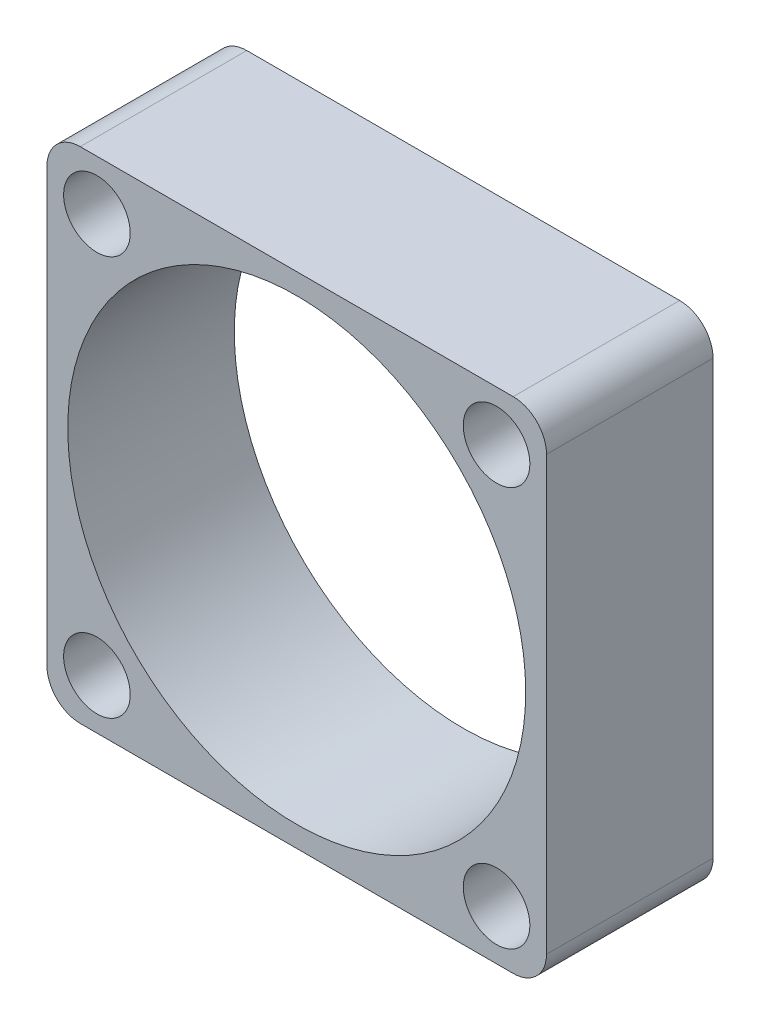
ISO-10303-21;
HEADER;
FILE_DESCRIPTION(('STEP AP214'),'2;1');
FILE_NAME('part.step','',(''),(''),'','','');
FILE_SCHEMA(('AUTOMOTIVE_DESIGN { 1 0 10303 214 1 1 1 1 }'));
ENDSEC;
DATA;
#1=APPLICATION_CONTEXT('core data for automotive mechanical design processes');
#2=APPLICATION_PROTOCOL_DEFINITION('international standard','automotive_design',2000,#1);
#3=PRODUCT_CONTEXT('',#1,'mechanical');
#4=PRODUCT('Part','Part','',(#3));
#5=PRODUCT_RELATED_PRODUCT_CATEGORY('part','',(#4));
#6=PRODUCT_DEFINITION_FORMATION('','',#4);
#7=PRODUCT_DEFINITION_CONTEXT('part definition',#1,'design');
#8=PRODUCT_DEFINITION('design','',#6,#7);
#9=PRODUCT_DEFINITION_SHAPE('','',#8);
#10=(LENGTH_UNIT() NAMED_UNIT(*) SI_UNIT(.MILLI.,.METRE.));
#11=(NAMED_UNIT(*) PLANE_ANGLE_UNIT() SI_UNIT($,.RADIAN.));
#12=(NAMED_UNIT(*) SI_UNIT($,.STERADIAN.) SOLID_ANGLE_UNIT());
#13=UNCERTAINTY_MEASURE_WITH_UNIT(LENGTH_MEASURE(1.E-05),#10,'distance_accuracy_value','');
#14=(GEOMETRIC_REPRESENTATION_CONTEXT(3) GLOBAL_UNCERTAINTY_ASSIGNED_CONTEXT((#13)) GLOBAL_UNIT_ASSIGNED_CONTEXT((#10,
#11,#12)) REPRESENTATION_CONTEXT('',''));
#15=CARTESIAN_POINT('',(0.,0.,0.));
#16=DIRECTION('',(0.,0.,1.));
#17=DIRECTION('',(1.,0.,0.));
#18=AXIS2_PLACEMENT_3D('',#15,#16,#17);
#19=CARTESIAN_POINT('',(0.,0.,10.));
#20=DIRECTION('',(1.,0.,0.));
#21=DIRECTION('',(0.,0.,-1.));
#22=AXIS2_PLACEMENT_3D('',#19,#20,#21);
#23=PLANE('',#22);
#24=DIRECTION('',(0.,-1.,0.));
#25=VECTOR('',#24,1.);
#26=CARTESIAN_POINT('',(0.,0.,0.));
#27=LINE('',#26,#25);
#28=CARTESIAN_POINT('',(0.,28.,0.));
#29=VERTEX_POINT('',#28);
#30=CARTESIAN_POINT('',(0.,2.,0.));
#31=VERTEX_POINT('',#30);
#32=EDGE_CURVE('E168',#29,#31,#27,.T.);
#33=ORIENTED_EDGE('',*,*,#32,.T.);
#34=DIRECTION('',(0.,0.,-1.));
#35=VECTOR('',#34,1.);
#36=CARTESIAN_POINT('',(0.,2.,10.));
#37=LINE('',#36,#35);
#38=CARTESIAN_POINT('',(0.,2.,10.));
#39=VERTEX_POINT('',#38);
#40=EDGE_CURVE('E144',#31,#39,#37,.F.);
#41=ORIENTED_EDGE('',*,*,#40,.T.);
#42=DIRECTION('',(0.,-1.,0.));
#43=VECTOR('',#42,1.);
#44=CARTESIAN_POINT('',(0.,0.,10.));
#45=LINE('',#44,#43);
#46=CARTESIAN_POINT('',(0.,28.,10.));
#47=VERTEX_POINT('',#46);
#48=EDGE_CURVE('E182',#47,#39,#45,.T.);
#49=ORIENTED_EDGE('',*,*,#48,.F.);
#50=DIRECTION('',(0.,0.,-1.));
#51=VECTOR('',#50,1.);
#52=CARTESIAN_POINT('',(0.,28.,10.));
#53=LINE('',#52,#51);
#54=EDGE_CURVE('E149',#47,#29,#53,.T.);
#55=ORIENTED_EDGE('',*,*,#54,.T.);
#56=EDGE_LOOP('',(#33,#41,#49,#55));
#57=FACE_BOUND('',#56,.T.);
#58=ADVANCED_FACE('F63',(#57),#23,.F.);
#59=CARTESIAN_POINT('',(0.,0.,10.));
#60=DIRECTION('',(0.,1.,0.));
#61=DIRECTION('',(0.,0.,1.));
#62=AXIS2_PLACEMENT_3D('',#59,#60,#61);
#63=PLANE('',#62);
#64=DIRECTION('',(1.,0.,0.));
#65=VECTOR('',#64,1.);
#66=CARTESIAN_POINT('',(0.,0.,10.));
#67=LINE('',#66,#65);
#68=CARTESIAN_POINT('',(2.,0.,10.));
#69=VERTEX_POINT('',#68);
#70=CARTESIAN_POINT('',(28.,0.,10.));
#71=VERTEX_POINT('',#70);
#72=EDGE_CURVE('E159',#69,#71,#67,.T.);
#73=ORIENTED_EDGE('',*,*,#72,.F.);
#74=DIRECTION('',(0.,0.,-1.));
#75=VECTOR('',#74,1.);
#76=CARTESIAN_POINT('',(2.,0.,10.));
#77=LINE('',#76,#75);
#78=CARTESIAN_POINT('',(2.,0.,0.));
#79=VERTEX_POINT('',#78);
#80=EDGE_CURVE('E143',#69,#79,#77,.T.);
#81=ORIENTED_EDGE('',*,*,#80,.T.);
#82=DIRECTION('',(1.,0.,0.));
#83=VECTOR('',#82,1.);
#84=CARTESIAN_POINT('',(0.,0.,0.));
#85=LINE('',#84,#83);
#86=CARTESIAN_POINT('',(28.,0.,0.));
#87=VERTEX_POINT('',#86);
#88=EDGE_CURVE('E156',#79,#87,#85,.T.);
#89=ORIENTED_EDGE('',*,*,#88,.T.);
#90=DIRECTION('',(0.,0.,-1.));
#91=VECTOR('',#90,1.);
#92=CARTESIAN_POINT('',(28.,0.,10.));
#93=LINE('',#92,#91);
#94=EDGE_CURVE('E162',#87,#71,#93,.F.);
#95=ORIENTED_EDGE('',*,*,#94,.T.);
#96=EDGE_LOOP('',(#73,#81,#89,#95));
#97=FACE_BOUND('',#96,.T.);
#98=ADVANCED_FACE('F155',(#97),#63,.F.);
#99=CARTESIAN_POINT('',(30.,0.,10.));
#100=DIRECTION('',(-1.,0.,0.));
#101=DIRECTION('',(0.,0.,1.));
#102=AXIS2_PLACEMENT_3D('',#99,#100,#101);
#103=PLANE('',#102);
#104=DIRECTION('',(0.,1.,0.));
#105=VECTOR('',#104,1.);
#106=CARTESIAN_POINT('',(30.,0.,10.));
#107=LINE('',#106,#105);
#108=CARTESIAN_POINT('',(30.,2.,10.));
#109=VERTEX_POINT('',#108);
#110=CARTESIAN_POINT('',(30.,28.,10.));
#111=VERTEX_POINT('',#110);
#112=EDGE_CURVE('E227',#109,#111,#107,.T.);
#113=ORIENTED_EDGE('',*,*,#112,.F.);
#114=DIRECTION('',(0.,0.,-1.));
#115=VECTOR('',#114,1.);
#116=CARTESIAN_POINT('',(30.,2.,10.));
#117=LINE('',#116,#115);
#118=CARTESIAN_POINT('',(30.,2.,0.));
#119=VERTEX_POINT('',#118);
#120=EDGE_CURVE('E209',#109,#119,#117,.T.);
#121=ORIENTED_EDGE('',*,*,#120,.T.);
#122=DIRECTION('',(0.,1.,0.));
#123=VECTOR('',#122,1.);
#124=CARTESIAN_POINT('',(30.,0.,0.));
#125=LINE('',#124,#123);
#126=CARTESIAN_POINT('',(30.,28.,0.));
#127=VERTEX_POINT('',#126);
#128=EDGE_CURVE('E167',#119,#127,#125,.T.);
#129=ORIENTED_EDGE('',*,*,#128,.T.);
#130=DIRECTION('',(0.,0.,-1.));
#131=VECTOR('',#130,1.);
#132=CARTESIAN_POINT('',(30.,28.,10.));
#133=LINE('',#132,#131);
#134=EDGE_CURVE('E206',#127,#111,#133,.F.);
#135=ORIENTED_EDGE('',*,*,#134,.T.);
#136=EDGE_LOOP('',(#113,#121,#129,#135));
#137=FACE_BOUND('',#136,.T.);
#138=ADVANCED_FACE('F246',(#137),#103,.F.);
#139=CARTESIAN_POINT('',(0.,30.,10.));
#140=DIRECTION('',(0.,-1.,0.));
#141=DIRECTION('',(0.,0.,-1.));
#142=AXIS2_PLACEMENT_3D('',#139,#140,#141);
#143=PLANE('',#142);
#144=DIRECTION('',(-1.,0.,0.));
#145=VECTOR('',#144,1.);
#146=CARTESIAN_POINT('',(0.,30.,0.));
#147=LINE('',#146,#145);
#148=CARTESIAN_POINT('',(28.,30.,0.));
#149=VERTEX_POINT('',#148);
#150=CARTESIAN_POINT('',(2.,30.,0.));
#151=VERTEX_POINT('',#150);
#152=EDGE_CURVE('E173',#149,#151,#147,.T.);
#153=ORIENTED_EDGE('',*,*,#152,.T.);
#154=DIRECTION('',(0.,0.,-1.));
#155=VECTOR('',#154,1.);
#156=CARTESIAN_POINT('',(2.,30.,10.));
#157=LINE('',#156,#155);
#158=CARTESIAN_POINT('',(2.,30.,10.));
#159=VERTEX_POINT('',#158);
#160=EDGE_CURVE('E12',#151,#159,#157,.F.);
#161=ORIENTED_EDGE('',*,*,#160,.T.);
#162=DIRECTION('',(-1.,0.,0.));
#163=VECTOR('',#162,1.);
#164=CARTESIAN_POINT('',(0.,30.,10.));
#165=LINE('',#164,#163);
#166=CARTESIAN_POINT('',(28.,30.,10.));
#167=VERTEX_POINT('',#166);
#168=EDGE_CURVE('E183',#167,#159,#165,.T.);
#169=ORIENTED_EDGE('',*,*,#168,.F.);
#170=DIRECTION('',(0.,0.,-1.));
#171=VECTOR('',#170,1.);
#172=CARTESIAN_POINT('',(28.,30.,10.));
#173=LINE('',#172,#171);
#174=EDGE_CURVE('E72',#167,#149,#173,.T.);
#175=ORIENTED_EDGE('',*,*,#174,.T.);
#176=EDGE_LOOP('',(#153,#161,#169,#175));
#177=FACE_BOUND('',#176,.T.);
#178=ADVANCED_FACE('F216',(#177),#143,.F.);
#179=CARTESIAN_POINT('',(0.,0.,10.));
#180=DIRECTION('',(0.,0.,-1.));
#181=DIRECTION('',(-1.,0.,0.));
#182=AXIS2_PLACEMENT_3D('',#179,#180,#181);
#183=PLANE('',#182);
#184=CARTESIAN_POINT('',(27.,27.,10.));
#185=DIRECTION('',(0.,0.,1.));
#186=DIRECTION('',(1.,0.,0.));
#187=AXIS2_PLACEMENT_3D('',#184,#185,#186);
#188=CIRCLE('',#187,2.00000000000001);
#189=CARTESIAN_POINT('',(29.,27.,10.));
#190=VERTEX_POINT('',#189);
#191=EDGE_CURVE('E403',#190,#190,#188,.T.);
#192=ORIENTED_EDGE('',*,*,#191,.F.);
#193=EDGE_LOOP('',(#192));
#194=FACE_BOUND('',#193,.T.);
#195=CARTESIAN_POINT('',(27.,3.,10.));
#196=DIRECTION('',(0.,0.,1.));
#197=DIRECTION('',(1.,0.,0.));
#198=AXIS2_PLACEMENT_3D('',#195,#196,#197);
#199=CIRCLE('',#198,2.);
#200=CARTESIAN_POINT('',(29.,3.,10.));
#201=VERTEX_POINT('',#200);
#202=EDGE_CURVE('E397',#201,#201,#199,.T.);
#203=ORIENTED_EDGE('',*,*,#202,.F.);
#204=EDGE_LOOP('',(#203));
#205=FACE_BOUND('',#204,.T.);
#206=CARTESIAN_POINT('',(2.99999999999999,3.,10.));
#207=DIRECTION('',(0.,0.,1.));
#208=DIRECTION('',(1.,0.,0.));
#209=AXIS2_PLACEMENT_3D('',#206,#207,#208);
#210=CIRCLE('',#209,2.);
#211=CARTESIAN_POINT('',(4.99999999999999,3.,10.));
#212=VERTEX_POINT('',#211);
#213=EDGE_CURVE('E390',#212,#212,#210,.T.);
#214=ORIENTED_EDGE('',*,*,#213,.F.);
#215=EDGE_LOOP('',(#214));
#216=FACE_BOUND('',#215,.T.);
#217=CARTESIAN_POINT('',(2.99999999999999,27.,10.));
#218=DIRECTION('',(0.,0.,1.));
#219=DIRECTION('',(1.,0.,0.));
#220=AXIS2_PLACEMENT_3D('',#217,#218,#219);
#221=CIRCLE('',#220,2.);
#222=CARTESIAN_POINT('',(4.99999999999999,27.,10.));
#223=VERTEX_POINT('',#222);
#224=EDGE_CURVE('E381',#223,#223,#221,.T.);
#225=ORIENTED_EDGE('',*,*,#224,.F.);
#226=EDGE_LOOP('',(#225));
#227=FACE_BOUND('',#226,.T.);
#228=CARTESIAN_POINT('',(15.,15.,10.));
#229=DIRECTION('',(0.,0.,1.));
#230=DIRECTION('',(1.,0.,0.));
#231=AXIS2_PLACEMENT_3D('',#228,#229,#230);
#232=CIRCLE('',#231,13.75);
#233=CARTESIAN_POINT('',(28.75,15.,10.));
#234=VERTEX_POINT('',#233);
#235=EDGE_CURVE('E230',#234,#234,#232,.T.);
#236=ORIENTED_EDGE('',*,*,#235,.F.);
#237=EDGE_LOOP('',(#236));
#238=FACE_BOUND('',#237,.T.);
#239=ORIENTED_EDGE('',*,*,#48,.T.);
#240=CARTESIAN_POINT('',(2.,2.,10.));
#241=DIRECTION('',(0.,0.,-1.));
#242=DIRECTION('',(-1.,0.,0.));
#243=AXIS2_PLACEMENT_3D('',#240,#241,#242);
#244=CIRCLE('',#243,2.);
#245=EDGE_CURVE('E203',#39,#69,#244,.F.);
#246=ORIENTED_EDGE('',*,*,#245,.T.);
#247=ORIENTED_EDGE('',*,*,#72,.T.);
#248=CARTESIAN_POINT('',(28.,2.,10.));
#249=DIRECTION('',(0.,0.,-1.));
#250=DIRECTION('',(-1.,0.,0.));
#251=AXIS2_PLACEMENT_3D('',#248,#249,#250);
#252=CIRCLE('',#251,2.);
#253=EDGE_CURVE('E201',#71,#109,#252,.F.);
#254=ORIENTED_EDGE('',*,*,#253,.T.);
#255=ORIENTED_EDGE('',*,*,#112,.T.);
#256=CARTESIAN_POINT('',(28.,28.,10.));
#257=DIRECTION('',(0.,0.,-1.));
#258=DIRECTION('',(-1.,0.,0.));
#259=AXIS2_PLACEMENT_3D('',#256,#257,#258);
#260=CIRCLE('',#259,2.);
#261=EDGE_CURVE('E89',#111,#167,#260,.F.);
#262=ORIENTED_EDGE('',*,*,#261,.T.);
#263=ORIENTED_EDGE('',*,*,#168,.T.);
#264=CARTESIAN_POINT('',(2.,28.,10.));
#265=DIRECTION('',(0.,0.,-1.));
#266=DIRECTION('',(-1.,0.,0.));
#267=AXIS2_PLACEMENT_3D('',#264,#265,#266);
#268=CIRCLE('',#267,2.);
#269=EDGE_CURVE('E198',#159,#47,#268,.F.);
#270=ORIENTED_EDGE('',*,*,#269,.T.);
#271=EDGE_LOOP('',(#239,#246,#247,#254,#255,#262,#263,#270));
#272=FACE_BOUND('',#271,.T.);
#273=ADVANCED_FACE('F235',(#194,#205,#216,#227,#238,#272),#183,.F.);
#274=CARTESIAN_POINT('',(0.,0.,0.));
#275=DIRECTION('',(0.,0.,-1.));
#276=DIRECTION('',(-1.,0.,0.));
#277=AXIS2_PLACEMENT_3D('',#274,#275,#276);
#278=PLANE('',#277);
#279=CARTESIAN_POINT('',(27.,27.,0.));
#280=DIRECTION('',(0.,0.,1.));
#281=DIRECTION('',(1.,0.,0.));
#282=AXIS2_PLACEMENT_3D('',#279,#280,#281);
#283=CIRCLE('',#282,2.00000000000001);
#284=CARTESIAN_POINT('',(29.,27.,0.));
#285=VERTEX_POINT('',#284);
#286=EDGE_CURVE('E400',#285,#285,#283,.T.);
#287=ORIENTED_EDGE('',*,*,#286,.T.);
#288=EDGE_LOOP('',(#287));
#289=FACE_BOUND('',#288,.T.);
#290=CARTESIAN_POINT('',(27.,3.,0.));
#291=DIRECTION('',(0.,0.,1.));
#292=DIRECTION('',(1.,0.,0.));
#293=AXIS2_PLACEMENT_3D('',#290,#291,#292);
#294=CIRCLE('',#293,2.);
#295=CARTESIAN_POINT('',(29.,3.,0.));
#296=VERTEX_POINT('',#295);
#297=EDGE_CURVE('E394',#296,#296,#294,.T.);
#298=ORIENTED_EDGE('',*,*,#297,.T.);
#299=EDGE_LOOP('',(#298));
#300=FACE_BOUND('',#299,.T.);
#301=CARTESIAN_POINT('',(2.99999999999999,3.,0.));
#302=DIRECTION('',(0.,0.,1.));
#303=DIRECTION('',(1.,0.,0.));
#304=AXIS2_PLACEMENT_3D('',#301,#302,#303);
#305=CIRCLE('',#304,2.);
#306=CARTESIAN_POINT('',(4.99999999999999,3.,0.));
#307=VERTEX_POINT('',#306);
#308=EDGE_CURVE('E387',#307,#307,#305,.T.);
#309=ORIENTED_EDGE('',*,*,#308,.T.);
#310=EDGE_LOOP('',(#309));
#311=FACE_BOUND('',#310,.T.);
#312=CARTESIAN_POINT('',(2.99999999999999,27.,0.));
#313=DIRECTION('',(0.,0.,1.));
#314=DIRECTION('',(1.,0.,0.));
#315=AXIS2_PLACEMENT_3D('',#312,#313,#314);
#316=CIRCLE('',#315,2.);
#317=CARTESIAN_POINT('',(4.99999999999999,27.,0.));
#318=VERTEX_POINT('',#317);
#319=EDGE_CURVE('E377',#318,#318,#316,.T.);
#320=ORIENTED_EDGE('',*,*,#319,.T.);
#321=EDGE_LOOP('',(#320));
#322=FACE_BOUND('',#321,.T.);
#323=CARTESIAN_POINT('',(15.,15.,0.));
#324=DIRECTION('',(0.,0.,1.));
#325=DIRECTION('',(1.,0.,0.));
#326=AXIS2_PLACEMENT_3D('',#323,#324,#325);
#327=CIRCLE('',#326,13.75);
#328=CARTESIAN_POINT('',(28.75,15.,0.));
#329=VERTEX_POINT('',#328);
#330=EDGE_CURVE('E176',#329,#329,#327,.T.);
#331=ORIENTED_EDGE('',*,*,#330,.T.);
#332=EDGE_LOOP('',(#331));
#333=FACE_BOUND('',#332,.T.);
#334=ORIENTED_EDGE('',*,*,#88,.F.);
#335=CARTESIAN_POINT('',(2.,2.,0.));
#336=DIRECTION('',(0.,0.,-1.));
#337=DIRECTION('',(-1.,0.,0.));
#338=AXIS2_PLACEMENT_3D('',#335,#336,#337);
#339=CIRCLE('',#338,2.);
#340=EDGE_CURVE('E139',#79,#31,#339,.T.);
#341=ORIENTED_EDGE('',*,*,#340,.T.);
#342=ORIENTED_EDGE('',*,*,#32,.F.);
#343=CARTESIAN_POINT('',(2.,28.,0.));
#344=DIRECTION('',(0.,0.,-1.));
#345=DIRECTION('',(-1.,0.,0.));
#346=AXIS2_PLACEMENT_3D('',#343,#344,#345);
#347=CIRCLE('',#346,2.);
#348=EDGE_CURVE('E187',#29,#151,#347,.T.);
#349=ORIENTED_EDGE('',*,*,#348,.T.);
#350=ORIENTED_EDGE('',*,*,#152,.F.);
#351=CARTESIAN_POINT('',(28.,28.,0.));
#352=DIRECTION('',(0.,0.,-1.));
#353=DIRECTION('',(-1.,0.,0.));
#354=AXIS2_PLACEMENT_3D('',#351,#352,#353);
#355=CIRCLE('',#354,2.);
#356=EDGE_CURVE('E161',#149,#127,#355,.T.);
#357=ORIENTED_EDGE('',*,*,#356,.T.);
#358=ORIENTED_EDGE('',*,*,#128,.F.);
#359=CARTESIAN_POINT('',(28.,2.,0.));
#360=DIRECTION('',(0.,0.,-1.));
#361=DIRECTION('',(-1.,0.,0.));
#362=AXIS2_PLACEMENT_3D('',#359,#360,#361);
#363=CIRCLE('',#362,2.);
#364=EDGE_CURVE('E150',#119,#87,#363,.T.);
#365=ORIENTED_EDGE('',*,*,#364,.T.);
#366=EDGE_LOOP('',(#334,#341,#342,#349,#350,#357,#358,#365));
#367=FACE_BOUND('',#366,.T.);
#368=ADVANCED_FACE('F164',(#289,#300,#311,#322,#333,#367),#278,.T.);
#369=CARTESIAN_POINT('',(15.,15.,0.));
#370=DIRECTION('',(0.,0.,1.));
#371=DIRECTION('',(1.,0.,0.));
#372=AXIS2_PLACEMENT_3D('',#369,#370,#371);
#373=CYLINDRICAL_SURFACE('',#372,13.75);
#374=ORIENTED_EDGE('',*,*,#330,.F.);
#375=EDGE_LOOP('',(#374));
#376=FACE_BOUND('',#375,.T.);
#377=ORIENTED_EDGE('',*,*,#235,.T.);
#378=EDGE_LOOP('',(#377));
#379=FACE_BOUND('',#378,.T.);
#380=ADVANCED_FACE('F243',(#376,#379),#373,.F.);
#381=CARTESIAN_POINT('',(2.99999999999999,27.,0.));
#382=DIRECTION('',(0.,0.,1.));
#383=DIRECTION('',(1.,0.,0.));
#384=AXIS2_PLACEMENT_3D('',#381,#382,#383);
#385=CYLINDRICAL_SURFACE('',#384,2.);
#386=ORIENTED_EDGE('',*,*,#319,.F.);
#387=EDGE_LOOP('',(#386));
#388=FACE_BOUND('',#387,.T.);
#389=ORIENTED_EDGE('',*,*,#224,.T.);
#390=EDGE_LOOP('',(#389));
#391=FACE_BOUND('',#390,.T.);
#392=ADVANCED_FACE('F305',(#388,#391),#385,.F.);
#393=CARTESIAN_POINT('',(2.99999999999999,3.,0.));
#394=DIRECTION('',(0.,0.,1.));
#395=DIRECTION('',(1.,0.,0.));
#396=AXIS2_PLACEMENT_3D('',#393,#394,#395);
#397=CYLINDRICAL_SURFACE('',#396,2.);
#398=ORIENTED_EDGE('',*,*,#308,.F.);
#399=EDGE_LOOP('',(#398));
#400=FACE_BOUND('',#399,.T.);
#401=ORIENTED_EDGE('',*,*,#213,.T.);
#402=EDGE_LOOP('',(#401));
#403=FACE_BOUND('',#402,.T.);
#404=ADVANCED_FACE('F301',(#400,#403),#397,.F.);
#405=CARTESIAN_POINT('',(27.,3.,0.));
#406=DIRECTION('',(0.,0.,1.));
#407=DIRECTION('',(1.,0.,0.));
#408=AXIS2_PLACEMENT_3D('',#405,#406,#407);
#409=CYLINDRICAL_SURFACE('',#408,2.);
#410=ORIENTED_EDGE('',*,*,#297,.F.);
#411=EDGE_LOOP('',(#410));
#412=FACE_BOUND('',#411,.T.);
#413=ORIENTED_EDGE('',*,*,#202,.T.);
#414=EDGE_LOOP('',(#413));
#415=FACE_BOUND('',#414,.T.);
#416=ADVANCED_FACE('F304',(#412,#415),#409,.F.);
#417=CARTESIAN_POINT('',(27.,27.,0.));
#418=DIRECTION('',(0.,0.,1.));
#419=DIRECTION('',(1.,0.,0.));
#420=AXIS2_PLACEMENT_3D('',#417,#418,#419);
#421=CYLINDRICAL_SURFACE('',#420,2.00000000000001);
#422=ORIENTED_EDGE('',*,*,#286,.F.);
#423=EDGE_LOOP('',(#422));
#424=FACE_BOUND('',#423,.T.);
#425=ORIENTED_EDGE('',*,*,#191,.T.);
#426=EDGE_LOOP('',(#425));
#427=FACE_BOUND('',#426,.T.);
#428=ADVANCED_FACE('F262',(#424,#427),#421,.F.);
#429=CARTESIAN_POINT('',(2.,2.,10.));
#430=DIRECTION('',(0.,0.,-1.));
#431=DIRECTION('',(-1.,0.,0.));
#432=AXIS2_PLACEMENT_3D('',#429,#430,#431);
#433=CYLINDRICAL_SURFACE('',#432,2.);
#434=ORIENTED_EDGE('',*,*,#245,.F.);
#435=ORIENTED_EDGE('',*,*,#40,.F.);
#436=ORIENTED_EDGE('',*,*,#340,.F.);
#437=ORIENTED_EDGE('',*,*,#80,.F.);
#438=EDGE_LOOP('',(#434,#435,#436,#437));
#439=FACE_BOUND('',#438,.T.);
#440=ADVANCED_FACE('F142',(#439),#433,.T.);
#441=CARTESIAN_POINT('',(28.,2.,10.));
#442=DIRECTION('',(0.,0.,-1.));
#443=DIRECTION('',(-1.,0.,0.));
#444=AXIS2_PLACEMENT_3D('',#441,#442,#443);
#445=CYLINDRICAL_SURFACE('',#444,2.);
#446=ORIENTED_EDGE('',*,*,#253,.F.);
#447=ORIENTED_EDGE('',*,*,#94,.F.);
#448=ORIENTED_EDGE('',*,*,#364,.F.);
#449=ORIENTED_EDGE('',*,*,#120,.F.);
#450=EDGE_LOOP('',(#446,#447,#448,#449));
#451=FACE_BOUND('',#450,.T.);
#452=ADVANCED_FACE('F261',(#451),#445,.T.);
#453=CARTESIAN_POINT('',(2.,28.,10.));
#454=DIRECTION('',(0.,0.,-1.));
#455=DIRECTION('',(-1.,0.,0.));
#456=AXIS2_PLACEMENT_3D('',#453,#454,#455);
#457=CYLINDRICAL_SURFACE('',#456,2.);
#458=ORIENTED_EDGE('',*,*,#269,.F.);
#459=ORIENTED_EDGE('',*,*,#160,.F.);
#460=ORIENTED_EDGE('',*,*,#348,.F.);
#461=ORIENTED_EDGE('',*,*,#54,.F.);
#462=EDGE_LOOP('',(#458,#459,#460,#461));
#463=FACE_BOUND('',#462,.T.);
#464=ADVANCED_FACE('F221',(#463),#457,.T.);
#465=CARTESIAN_POINT('',(28.,28.,10.));
#466=DIRECTION('',(0.,0.,-1.));
#467=DIRECTION('',(-1.,0.,0.));
#468=AXIS2_PLACEMENT_3D('',#465,#466,#467);
#469=CYLINDRICAL_SURFACE('',#468,2.);
#470=ORIENTED_EDGE('',*,*,#261,.F.);
#471=ORIENTED_EDGE('',*,*,#134,.F.);
#472=ORIENTED_EDGE('',*,*,#356,.F.);
#473=ORIENTED_EDGE('',*,*,#174,.F.);
#474=EDGE_LOOP('',(#470,#471,#472,#473));
#475=FACE_BOUND('',#474,.T.);
#476=ADVANCED_FACE('F65',(#475),#469,.T.);
#477=CLOSED_SHELL('',(#58,#98,#138,#178,#273,#368,#380,#392,#404,#416,#428,#440,#452,#464,#476));
#478=MANIFOLD_SOLID_BREP('B2',#477);
#479=ADVANCED_BREP_SHAPE_REPRESENTATION('',(#18,#478),#14);
#480=SHAPE_DEFINITION_REPRESENTATION(#9,#479);
ENDSEC;
END-ISO-10303-21;
